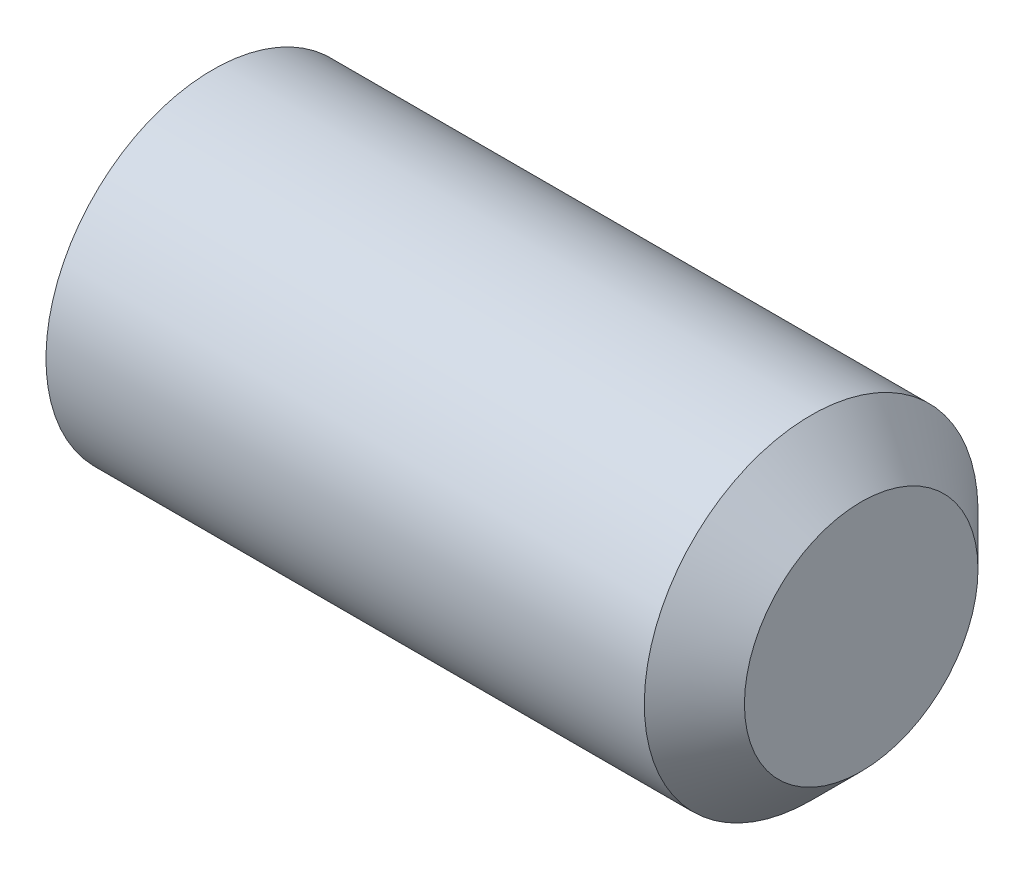
ISO-10303-21;
HEADER;
FILE_DESCRIPTION(('STEP AP214'),'2;1');
FILE_NAME('part.step','',(''),(''),'','','');
FILE_SCHEMA(('AUTOMOTIVE_DESIGN { 1 0 10303 214 1 1 1 1 }'));
ENDSEC;
DATA;
#1=APPLICATION_CONTEXT('core data for automotive mechanical design processes');
#2=APPLICATION_PROTOCOL_DEFINITION('international standard','automotive_design',2000,#1);
#3=PRODUCT_CONTEXT('',#1,'mechanical');
#4=PRODUCT('Part','Part','',(#3));
#5=PRODUCT_RELATED_PRODUCT_CATEGORY('part','',(#4));
#6=PRODUCT_DEFINITION_FORMATION('','',#4);
#7=PRODUCT_DEFINITION_CONTEXT('part definition',#1,'design');
#8=PRODUCT_DEFINITION('design','',#6,#7);
#9=PRODUCT_DEFINITION_SHAPE('','',#8);
#10=(LENGTH_UNIT() NAMED_UNIT(*) SI_UNIT(.MILLI.,.METRE.));
#11=(NAMED_UNIT(*) PLANE_ANGLE_UNIT() SI_UNIT($,.RADIAN.));
#12=(NAMED_UNIT(*) SI_UNIT($,.STERADIAN.) SOLID_ANGLE_UNIT());
#13=UNCERTAINTY_MEASURE_WITH_UNIT(LENGTH_MEASURE(1.E-05),#10,'distance_accuracy_value','');
#14=(GEOMETRIC_REPRESENTATION_CONTEXT(3) GLOBAL_UNCERTAINTY_ASSIGNED_CONTEXT((#13)) GLOBAL_UNIT_ASSIGNED_CONTEXT((#10,
#11,#12)) REPRESENTATION_CONTEXT('',''));
#15=CARTESIAN_POINT('',(0.,0.,0.));
#16=DIRECTION('',(0.,0.,1.));
#17=DIRECTION('',(1.,0.,0.));
#18=AXIS2_PLACEMENT_3D('',#15,#16,#17);
#19=CARTESIAN_POINT('',(0.83333333333333,0.,0.));
#20=DIRECTION('',(-1.,0.,0.));
#21=DIRECTION('',(0.,-1.,0.));
#22=AXIS2_PLACEMENT_3D('',#19,#20,#21);
#23=CONICAL_SURFACE('',#22,0.,1.04719755119661);
#24=CARTESIAN_POINT('',(0.,0.,0.));
#25=DIRECTION('',(-1.,0.,0.));
#26=DIRECTION('',(0.,-1.,0.));
#27=AXIS2_PLACEMENT_3D('',#24,#25,#26);
#28=CIRCLE('',#27,1.4433756729741);
#29=CARTESIAN_POINT('',(0.,0.,1.4433756729741));
#30=VERTEX_POINT('',#29);
#31=CARTESIAN_POINT('',(0.,1.25000000000006,0.721687836486994));
#32=VERTEX_POINT('',#31);
#33=EDGE_CURVE('E133',#30,#32,#28,.T.);
#34=ORIENTED_EDGE('',*,*,#33,.T.);
#35=CARTESIAN_POINT('',(-6.667466600569E-05,1.2502,0.721572366433192));
#36=CARTESIAN_POINT('',(0.01825408523633,1.19526669476824,0.753288124996229));
#37=CARTESIAN_POINT('',(0.0349166937993818,1.13985921349976,0.785277649221703));
#38=CARTESIAN_POINT('',(0.0640026960542467,1.02808463239966,0.849810733708406));
#39=CARTESIAN_POINT('',(0.0764157980239654,0.971715545158294,0.882355441401186));
#40=CARTESIAN_POINT('',(0.0957403123640013,0.859676025913021,0.947041487997324));
#41=CARTESIAN_POINT('',(0.10278031055258,0.804022841540777,0.9791728689759));
#42=CARTESIAN_POINT('',(0.111187567369377,0.692454346091617,1.04358696985656));
#43=CARTESIAN_POINT('',(0.112561784795285,0.636539441062409,1.07586945532689));
#44=CARTESIAN_POINT('',(0.109716662632088,0.532042078818284,1.13620103554814));
#45=CARTESIAN_POINT('',(0.106195901179992,0.483444050118692,1.16425912049994));
#46=CARTESIAN_POINT('',(0.0950328873007498,0.386564637826768,1.22019247526561));
#47=CARTESIAN_POINT('',(0.0873868144273279,0.338283589807842,1.2480675513361));
#48=CARTESIAN_POINT('',(0.0682705452994721,0.241204116145961,1.30411641158758));
#49=CARTESIAN_POINT('',(0.0567192430203453,0.192417989648104,1.33228309485383));
#50=CARTESIAN_POINT('',(0.0305016853061096,0.0955737477078995,1.38819614400748));
#51=CARTESIAN_POINT('',(0.0158415978608945,0.0475143896730366,1.41594322730599));
#52=CARTESIAN_POINT('',(-6.66746660268139E-05,-0.000199999999999919,1.44349114302794));
#53=B_SPLINE_CURVE_WITH_KNOTS('',3,(#35,#36,#37,#38,#39,#40,#41,#42,#43,#44,#45,#46,#47,#48,#49,
#50,#51,#52),.UNSPECIFIED.,.F.,.F.,(4,2,2,2,2,2,2,2,4),(0.,0.198150821029558,0.396778196315219,
0.590488617354397,0.783961049317179,0.952480056398648,1.1211553973001,1.29357430343591,
1.46565426976932),.UNSPECIFIED.);
#54=EDGE_CURVE('E11',#32,#30,#53,.T.);
#55=ORIENTED_EDGE('',*,*,#54,.T.);
#56=EDGE_LOOP('',(#34,#55));
#57=FACE_BOUND('',#56,.T.);
#58=ADVANCED_FACE('F31',(#57),#23,.F.);
#59=CARTESIAN_POINT('',(0.,-1.25,0.72168783648703));
#60=VERTEX_POINT('',#59);
#61=EDGE_CURVE('E129',#60,#30,#28,.T.);
#62=ORIENTED_EDGE('',*,*,#61,.T.);
#63=CARTESIAN_POINT('',(-6.66746660267947E-05,0.0002,1.44349114302794));
#64=CARTESIAN_POINT('',(0.0182540852363106,-0.0547333052317654,1.4117753844649));
#65=CARTESIAN_POINT('',(0.0349166937993642,-0.11014078650024,1.37978586023943));
#66=CARTESIAN_POINT('',(0.064002696054233,-0.221915367600341,1.31525277575272));
#67=CARTESIAN_POINT('',(0.0764157980239536,-0.278284454841712,1.28270806805994));
#68=CARTESIAN_POINT('',(0.0957403123639934,-0.390323974086986,1.2180220214638));
#69=CARTESIAN_POINT('',(0.102780310552574,-0.445977158459232,1.18589064048522));
#70=CARTESIAN_POINT('',(0.111187567369375,-0.557545653908395,1.12147653960457));
#71=CARTESIAN_POINT('',(0.112561784795285,-0.613460558937604,1.08919405413424));
#72=CARTESIAN_POINT('',(0.109716662632091,-0.717957921181729,1.02886247391298));
#73=CARTESIAN_POINT('',(0.106195901179996,-0.766555949881319,1.00080438896119));
#74=CARTESIAN_POINT('',(0.0950328873007579,-0.863435362173241,0.944871034195511));
#75=CARTESIAN_POINT('',(0.0873868144273376,-0.911716410192165,0.916995958125027));
#76=CARTESIAN_POINT('',(0.0682705452994852,-1.00879588385404,0.860947097873551));
#77=CARTESIAN_POINT('',(0.0567192430203601,-1.0575820103519,0.832780414607293));
#78=CARTESIAN_POINT('',(0.0305016853061278,-1.1544262522921,0.776867365453649));
#79=CARTESIAN_POINT('',(0.0158415978609144,-1.20248561032696,0.749120282155139));
#80=CARTESIAN_POINT('',(-6.66746660053359E-05,-1.2502,0.721572366433192));
#81=B_SPLINE_CURVE_WITH_KNOTS('',3,(#63,#64,#65,#66,#67,#68,#69,#70,#71,#72,#73,#74,#75,#76,#77,
#78,#79,#80),.UNSPECIFIED.,.F.,.F.,(4,2,2,2,2,2,2,2,4),(0.,0.198150821029563,0.396778196315229,
0.590488617354411,0.783961049317198,0.952480056398662,1.12115539730011,1.29357430343592,
1.46565426976932),.UNSPECIFIED.);
#82=EDGE_CURVE('E44',#30,#60,#81,.T.);
#83=ORIENTED_EDGE('',*,*,#82,.T.);
#84=EDGE_LOOP('',(#62,#83));
#85=FACE_BOUND('',#84,.T.);
#86=ADVANCED_FACE('F199',(#85),#23,.F.);
#87=CARTESIAN_POINT('',(0.,-1.25,-0.72168783648703));
#88=VERTEX_POINT('',#87);
#89=EDGE_CURVE('E128',#88,#60,#28,.T.);
#90=ORIENTED_EDGE('',*,*,#89,.T.);
#91=CARTESIAN_POINT('',(-0.464794110924318,-1.25,-1.8689314017922));
#92=CARTESIAN_POINT('',(-0.438896838466503,-1.25,-1.81495202267028));
#93=CARTESIAN_POINT('',(-0.41326862193117,-1.25,-1.76084125344199));
#94=CARTESIAN_POINT('',(-0.362702760613372,-1.25,-1.65228662652069));
#95=CARTESIAN_POINT('',(-0.337765240110292,-1.25,-1.5978427110077));
#96=CARTESIAN_POINT('',(-0.288593916349812,-1.25,-1.48823931692677));
#97=CARTESIAN_POINT('',(-0.26436529948678,-1.25,-1.43307750108909));
#98=CARTESIAN_POINT('',(-0.216995070503893,-1.25,-1.32229188443623));
#99=CARTESIAN_POINT('',(-0.1938534018645,-1.25,-1.26666810781964));
#100=CARTESIAN_POINT('',(-0.148354613067788,-1.25,-1.15340083047609));
#101=CARTESIAN_POINT('',(-0.126033815465283,-1.25,-1.09574254265117));
#102=CARTESIAN_POINT('',(-0.0832554769119706,-1.25,-0.979741082890186));
#103=CARTESIAN_POINT('',(-0.0627981694396736,-1.25,-0.921397826164648));
#104=CARTESIAN_POINT('',(-0.00508423767619977,-1.25,-0.745435524772247));
#105=CARTESIAN_POINT('',(0.0286497850231131,-1.25,-0.626561938132864));
#106=CARTESIAN_POINT('',(0.0677795931717897,-1.25,-0.445873083681241));
#107=CARTESIAN_POINT('',(0.0789059393811716,-1.25,-0.38530470019277));
#108=CARTESIAN_POINT('',(0.0965721477324262,-1.25,-0.263486592065033));
#109=CARTESIAN_POINT('',(0.103112319816836,-1.25,-0.202236913753249));
#110=CARTESIAN_POINT('',(0.111001218957225,-1.25,-0.0801324468775872));
#111=CARTESIAN_POINT('',(0.112411208741845,-1.25,-0.0192817197887191));
#112=CARTESIAN_POINT('',(0.110083812113812,-1.25,0.102319232701149));
#113=CARTESIAN_POINT('',(0.106346106973973,-1.25,0.163069451645857));
#114=CARTESIAN_POINT('',(0.0911019719638763,-1.25,0.312961598922923));
#115=CARTESIAN_POINT('',(0.07673875157032,-1.25,0.401813055628261));
#116=CARTESIAN_POINT('',(0.0397001504850788,-1.25,0.577788146583204));
#117=CARTESIAN_POINT('',(0.017014751645873,-1.25,0.664909564430757));
#118=CARTESIAN_POINT('',(-0.0217374532821144,-1.25,0.795209224728803));
#119=CARTESIAN_POINT('',(-0.0356229448102493,-1.25,0.839061001813546));
#120=CARTESIAN_POINT('',(-0.0646784153621005,-1.25,0.926308087473968));
#121=CARTESIAN_POINT('',(-0.0798475927664177,-1.25,0.969703662172475));
#122=CARTESIAN_POINT('',(-0.111250133996538,-1.25,1.05609633508796));
#123=CARTESIAN_POINT('',(-0.127483304422963,-1.25,1.09909350410935));
#124=CARTESIAN_POINT('',(-0.160838243910764,-1.25,1.18474903910482));
#125=CARTESIAN_POINT('',(-0.17796016310432,-1.25,1.22740734642401));
#126=CARTESIAN_POINT('',(-0.222761429232114,-1.25,1.33629459550827));
#127=CARTESIAN_POINT('',(-0.2509693835735,-1.25,1.4023058109203));
#128=CARTESIAN_POINT('',(-0.30874508115846,-1.25,1.53373213594214));
#129=CARTESIAN_POINT('',(-0.338312926269893,-1.25,1.59914720045377));
#130=CARTESIAN_POINT('',(-0.428576920024365,-1.25,1.79469680395945));
#131=CARTESIAN_POINT('',(-0.490824273185165,-1.25,1.92411390982371));
#132=CARTESIAN_POINT('',(-0.617929622902711,-1.25,2.18184246876938));
#133=CARTESIAN_POINT('',(-0.682790734765014,-1.25,2.31015236703664));
#134=CARTESIAN_POINT('',(-0.814180745531415,-1.25,2.56589305685457));
#135=CARTESIAN_POINT('',(-0.880709432442644,-1.25,2.6933239575489));
#136=CARTESIAN_POINT('',(-1.0085820016458,-1.25,2.93557826301824));
#137=CARTESIAN_POINT('',(-1.06982257041214,-1.25,3.05045639113078));
#138=CARTESIAN_POINT('',(-1.19300148004087,-1.25,3.27984311898857));
#139=CARTESIAN_POINT('',(-1.25493984672611,-1.25,3.39435170485541));
#140=CARTESIAN_POINT('',(-1.37918115605609,-1.25,3.6227932787217));
#141=CARTESIAN_POINT('',(-1.44148277067592,-1.25,3.73672698995316));
#142=CARTESIAN_POINT('',(-1.56649149193143,-1.25,3.96436406629498));
#143=CARTESIAN_POINT('',(-1.62919857717608,-1.25,4.0780674431479));
#144=CARTESIAN_POINT('',(-1.69205434936227,-1.25,4.19168806612957));
#145=B_SPLINE_CURVE_WITH_KNOTS('',3,(#91,#92,#93,#94,#95,#96,#97,#98,#99,#100,#101,#102,#103,
#104,#105,#106,#107,#108,#109,#110,#111,#112,#113,#114,#115,#116,#117,#118,#119,#120,#121,#122,
#123,#124,#125,#126,#127,#128,#129,#130,#131,#132,#133,#134,#135,#136,#137,#138,#139,#140,#141,
#142,#143,#144),.UNSPECIFIED.,.F.,.F.,(4,2,2,2,2,2,2,2,2,2,2,2,2,2,2,2,2,2,2,2,2,2,2,2,2,2,4),
(0.,0.17961292671252,0.359257964580633,0.539992735616922,0.720718098311231,0.906167781883899,
1.09164066876281,1.46154014621253,1.64614554413151,1.83073846485716,2.01311967401944,
2.1955121760931,2.46497297688038,2.73475922178122,2.87273702323334,3.01062928909402,
3.14849655975692,3.28638719597095,3.50172172546914,3.71707241178646,4.14784491349871,
4.57914698286387,5.01039449766875,5.40093821140483,5.79149642546544,6.18106124184776,
6.57060567131898),.UNSPECIFIED.);
#146=EDGE_CURVE('E175',#60,#88,#145,.F.);
#147=ORIENTED_EDGE('',*,*,#146,.T.);
#148=EDGE_LOOP('',(#90,#147));
#149=FACE_BOUND('',#148,.T.);
#150=ADVANCED_FACE('F205',(#149),#23,.F.);
#151=CARTESIAN_POINT('',(0.,0.,-1.4433756729741));
#152=VERTEX_POINT('',#151);
#153=EDGE_CURVE('E227',#152,#88,#28,.T.);
#154=ORIENTED_EDGE('',*,*,#153,.T.);
#155=CARTESIAN_POINT('',(-6.6674666005365E-05,-1.2502,-0.721572366433192));
#156=CARTESIAN_POINT('',(0.0182540852363302,-1.19526669476824,-0.753288124996229));
#157=CARTESIAN_POINT('',(0.0349166937993819,-1.13985921349976,-0.785277649221703));
#158=CARTESIAN_POINT('',(0.064002696054247,-1.02808463239966,-0.849810733708406));
#159=CARTESIAN_POINT('',(0.0764157980239657,-0.971715545158294,-0.882355441401186));
#160=CARTESIAN_POINT('',(0.0957403123640016,-0.859676025913021,-0.947041487997324));
#161=CARTESIAN_POINT('',(0.10278031055258,-0.804022841540777,-0.9791728689759));
#162=CARTESIAN_POINT('',(0.111187567369377,-0.692454346091617,-1.04358696985656));
#163=CARTESIAN_POINT('',(0.112561784795285,-0.636539441062409,-1.07586945532689));
#164=CARTESIAN_POINT('',(0.109716662632088,-0.532042078818284,-1.13620103554814));
#165=CARTESIAN_POINT('',(0.106195901179992,-0.483444050118693,-1.16425912049994));
#166=CARTESIAN_POINT('',(0.09503288730075,-0.386564637826768,-1.22019247526561));
#167=CARTESIAN_POINT('',(0.087386814427328,-0.338283589807842,-1.2480675513361));
#168=CARTESIAN_POINT('',(0.0682705452994722,-0.241204116145961,-1.30411641158758));
#169=CARTESIAN_POINT('',(0.0567192430203454,-0.192417989648104,-1.33228309485383));
#170=CARTESIAN_POINT('',(0.0305016853061098,-0.0955737477078995,-1.38819614400748));
#171=CARTESIAN_POINT('',(0.0158415978608947,-0.0475143896730366,-1.41594322730599));
#172=CARTESIAN_POINT('',(-6.66746660267868E-05,0.000199999999999902,-1.44349114302794));
#173=B_SPLINE_CURVE_WITH_KNOTS('',3,(#155,#156,#157,#158,#159,#160,#161,#162,#163,#164,#165,
#166,#167,#168,#169,#170,#171,#172),.UNSPECIFIED.,.F.,.F.,(4,2,2,2,2,2,2,2,4),(0.,
0.198150821029558,0.396778196315219,0.590488617354397,0.783961049317178,0.952480056398648,
1.1211553973001,1.29357430343591,1.46565426976932),.UNSPECIFIED.);
#174=EDGE_CURVE('E170',#88,#152,#173,.T.);
#175=ORIENTED_EDGE('',*,*,#174,.T.);
#176=EDGE_LOOP('',(#154,#175));
#177=FACE_BOUND('',#176,.T.);
#178=ADVANCED_FACE('F217',(#177),#23,.F.);
#179=CARTESIAN_POINT('',(0.,1.25,-0.72168783648703));
#180=VERTEX_POINT('',#179);
#181=EDGE_CURVE('E225',#180,#152,#28,.T.);
#182=ORIENTED_EDGE('',*,*,#181,.T.);
#183=CARTESIAN_POINT('',(-6.66746660267947E-05,-0.0002,-1.44349114302794));
#184=CARTESIAN_POINT('',(0.0182540852363107,0.0547333052317654,-1.4117753844649));
#185=CARTESIAN_POINT('',(0.0349166937993643,0.11014078650024,-1.37978586023943));
#186=CARTESIAN_POINT('',(0.0640026960542331,0.221915367600341,-1.31525277575272));
#187=CARTESIAN_POINT('',(0.0764157980239537,0.278284454841712,-1.28270806805994));
#188=CARTESIAN_POINT('',(0.0957403123639935,0.390323974086987,-1.2180220214638));
#189=CARTESIAN_POINT('',(0.102780310552574,0.445977158459232,-1.18589064048522));
#190=CARTESIAN_POINT('',(0.111187567369375,0.557545653908395,-1.12147653960457));
#191=CARTESIAN_POINT('',(0.112561784795285,0.613460558937604,-1.08919405413424));
#192=CARTESIAN_POINT('',(0.109716662632091,0.717957921181729,-1.02886247391298));
#193=CARTESIAN_POINT('',(0.106195901179996,0.766555949881319,-1.00080438896119));
#194=CARTESIAN_POINT('',(0.0950328873007576,0.863435362173241,-0.944871034195511));
#195=CARTESIAN_POINT('',(0.0873868144273374,0.911716410192166,-0.916995958125026));
#196=CARTESIAN_POINT('',(0.0682705452994849,1.00879588385404,-0.86094709787355));
#197=CARTESIAN_POINT('',(0.0567192430203598,1.0575820103519,-0.832780414607293));
#198=CARTESIAN_POINT('',(0.0305016853061274,1.1544262522921,-0.776867365453649));
#199=CARTESIAN_POINT('',(0.015841597860914,1.20248561032696,-0.74912028215514));
#200=CARTESIAN_POINT('',(-6.66746660057536E-05,1.2502,-0.721572366433192));
#201=B_SPLINE_CURVE_WITH_KNOTS('',3,(#183,#184,#185,#186,#187,#188,#189,#190,#191,#192,#193,
#194,#195,#196,#197,#198,#199,#200),.UNSPECIFIED.,.F.,.F.,(4,2,2,2,2,2,2,2,4),(0.,
0.198150821029563,0.396778196315229,0.590488617354412,0.783961049317198,0.952480056398663,
1.12115539730011,1.29357430343592,1.46565426976932),.UNSPECIFIED.);
#202=EDGE_CURVE('E111',#152,#180,#201,.T.);
#203=ORIENTED_EDGE('',*,*,#202,.T.);
#204=EDGE_LOOP('',(#182,#203));
#205=FACE_BOUND('',#204,.T.);
#206=ADVANCED_FACE('F209',(#205),#23,.F.);
#207=EDGE_CURVE('E221',#32,#180,#28,.T.);
#208=ORIENTED_EDGE('',*,*,#207,.T.);
#209=CARTESIAN_POINT('',(-0.464794110924318,1.25,-1.8689314017922));
#210=CARTESIAN_POINT('',(-0.438896838466503,1.25,-1.81495202267028));
#211=CARTESIAN_POINT('',(-0.41326862193117,1.25,-1.76084125344199));
#212=CARTESIAN_POINT('',(-0.362702760613372,1.25,-1.65228662652069));
#213=CARTESIAN_POINT('',(-0.337765240110292,1.25,-1.5978427110077));
#214=CARTESIAN_POINT('',(-0.288593916349812,1.25,-1.48823931692677));
#215=CARTESIAN_POINT('',(-0.26436529948678,1.25,-1.43307750108909));
#216=CARTESIAN_POINT('',(-0.216995070503893,1.25,-1.32229188443623));
#217=CARTESIAN_POINT('',(-0.1938534018645,1.25,-1.26666810781964));
#218=CARTESIAN_POINT('',(-0.148354613067788,1.25,-1.15340083047609));
#219=CARTESIAN_POINT('',(-0.126033815465283,1.25,-1.09574254265116));
#220=CARTESIAN_POINT('',(-0.0832554769119708,1.25,-0.979741082890186));
#221=CARTESIAN_POINT('',(-0.0627981694396738,1.25,-0.921397826164648));
#222=CARTESIAN_POINT('',(-0.0050842376762001,1.25,-0.745435524772246));
#223=CARTESIAN_POINT('',(0.0286497850231126,1.25,-0.626561938132864));
#224=CARTESIAN_POINT('',(0.0677795931717892,1.25,-0.445873083681241));
#225=CARTESIAN_POINT('',(0.0789059393811712,1.25,-0.38530470019277));
#226=CARTESIAN_POINT('',(0.0965721477324258,1.25,-0.263486592065032));
#227=CARTESIAN_POINT('',(0.103112319816835,1.25,-0.202236913753249));
#228=CARTESIAN_POINT('',(0.111001218957225,1.25,-0.0801324468775868));
#229=CARTESIAN_POINT('',(0.112411208741845,1.25,-0.0192817197887186));
#230=CARTESIAN_POINT('',(0.110083812113811,1.25,0.10231923270115));
#231=CARTESIAN_POINT('',(0.106346106973973,1.25,0.163069451645857));
#232=CARTESIAN_POINT('',(0.0911019719638757,1.25,0.312961598922924));
#233=CARTESIAN_POINT('',(0.0767387515703193,1.25,0.401813055628261));
#234=CARTESIAN_POINT('',(0.0397001504850779,1.25,0.577788146583205));
#235=CARTESIAN_POINT('',(0.0170147516458721,1.25,0.664909564430757));
#236=CARTESIAN_POINT('',(-0.0217374532821151,1.25,0.795209224728804));
#237=CARTESIAN_POINT('',(-0.0356229448102498,1.25,0.839061001813547));
#238=CARTESIAN_POINT('',(-0.0646784153621009,1.25,0.926308087473968));
#239=CARTESIAN_POINT('',(-0.0798475927664181,1.25,0.969703662172476));
#240=CARTESIAN_POINT('',(-0.111250133996538,1.25,1.05609633508796));
#241=CARTESIAN_POINT('',(-0.127483304422964,1.25,1.09909350410935));
#242=CARTESIAN_POINT('',(-0.160838243910764,1.25,1.18474903910482));
#243=CARTESIAN_POINT('',(-0.177960163104321,1.25,1.22740734642401));
#244=CARTESIAN_POINT('',(-0.222761429232114,1.25,1.33629459550827));
#245=CARTESIAN_POINT('',(-0.250969383573501,1.25,1.40230581092031));
#246=CARTESIAN_POINT('',(-0.30874508115846,1.25,1.53373213594214));
#247=CARTESIAN_POINT('',(-0.338312926269894,1.25,1.59914720045377));
#248=CARTESIAN_POINT('',(-0.428576920024366,1.25,1.79469680395945));
#249=CARTESIAN_POINT('',(-0.490824273185165,1.25,1.92411390982371));
#250=CARTESIAN_POINT('',(-0.617929622902712,1.25,2.18184246876939));
#251=CARTESIAN_POINT('',(-0.682790734765015,1.25,2.31015236703664));
#252=CARTESIAN_POINT('',(-0.814180745531416,1.25,2.56589305685457));
#253=CARTESIAN_POINT('',(-0.880709432442645,1.25,2.6933239575489));
#254=CARTESIAN_POINT('',(-1.0085820016458,1.25,2.93557826301824));
#255=CARTESIAN_POINT('',(-1.06982257041214,1.25,3.05045639113078));
#256=CARTESIAN_POINT('',(-1.19300148004087,1.25,3.27984311898857));
#257=CARTESIAN_POINT('',(-1.25493984672611,1.25,3.39435170485541));
#258=CARTESIAN_POINT('',(-1.3791811560561,1.25,3.62279327872171));
#259=CARTESIAN_POINT('',(-1.44148277067592,1.25,3.73672698995316));
#260=CARTESIAN_POINT('',(-1.56649149193143,1.25,3.96436406629498));
#261=CARTESIAN_POINT('',(-1.62919857717608,1.25,4.07806744314791));
#262=CARTESIAN_POINT('',(-1.69205434936227,1.25,4.19168806612957));
#263=B_SPLINE_CURVE_WITH_KNOTS('',3,(#209,#210,#211,#212,#213,#214,#215,#216,#217,#218,#219,
#220,#221,#222,#223,#224,#225,#226,#227,#228,#229,#230,#231,#232,#233,#234,#235,#236,#237,#238,
#239,#240,#241,#242,#243,#244,#245,#246,#247,#248,#249,#250,#251,#252,#253,#254,#255,#256,#257,
#258,#259,#260,#261,#262),.UNSPECIFIED.,.F.,.F.,(4,2,2,2,2,2,2,2,2,2,2,2,2,2,2,2,2,2,2,2,2,2,2,
2,2,2,4),(0.,0.17961292671252,0.359257964580634,0.539992735616922,0.720718098311232,
0.9061677818839,1.09164066876281,1.46154014621253,1.64614554413151,1.83073846485716,
2.01311967401944,2.1955121760931,2.46497297688039,2.73475922178122,2.87273702323334,
3.01062928909402,3.14849655975692,3.28638719597095,3.50172172546914,3.71707241178646,
4.14784491349871,4.57914698286387,5.01039449766875,5.40093821140483,5.79149642546544,
6.18106124184777,6.57060567131898),.UNSPECIFIED.);
#264=EDGE_CURVE('E77',#180,#32,#263,.T.);
#265=ORIENTED_EDGE('',*,*,#264,.T.);
#266=EDGE_LOOP('',(#208,#265));
#267=FACE_BOUND('',#266,.T.);
#268=ADVANCED_FACE('F201',(#267),#23,.F.);
#269=CARTESIAN_POINT('',(10.,0.,0.));
#270=DIRECTION('',(1.,0.,0.));
#271=DIRECTION('',(0.,1.,0.));
#272=AXIS2_PLACEMENT_3D('',#269,#270,#271);
#273=PLANE('',#272);
#274=CARTESIAN_POINT('',(10.,0.,0.));
#275=DIRECTION('',(-1.,0.,0.));
#276=DIRECTION('',(0.,-1.,0.));
#277=AXIS2_PLACEMENT_3D('',#274,#275,#276);
#278=CIRCLE('',#277,1.75);
#279=CARTESIAN_POINT('',(10.,-1.75,0.));
#280=VERTEX_POINT('',#279);
#281=EDGE_CURVE('E142',#280,#280,#278,.T.);
#282=ORIENTED_EDGE('',*,*,#281,.F.);
#283=EDGE_LOOP('',(#282));
#284=FACE_BOUND('',#283,.T.);
#285=ADVANCED_FACE('F33',(#284),#273,.T.);
#286=CARTESIAN_POINT('',(9.25,0.,0.));
#287=DIRECTION('',(-1.,0.,0.));
#288=DIRECTION('',(0.,-1.,0.));
#289=AXIS2_PLACEMENT_3D('',#286,#287,#288);
#290=CONICAL_SURFACE('',#289,2.5,0.785398163397448);
#291=ORIENTED_EDGE('',*,*,#281,.T.);
#292=EDGE_LOOP('',(#291));
#293=FACE_BOUND('',#292,.T.);
#294=CARTESIAN_POINT('',(9.25,0.,0.));
#295=DIRECTION('',(-1.,0.,0.));
#296=DIRECTION('',(0.,-1.,0.));
#297=AXIS2_PLACEMENT_3D('',#294,#295,#296);
#298=CIRCLE('',#297,2.5);
#299=CARTESIAN_POINT('',(9.25,-2.5,0.));
#300=VERTEX_POINT('',#299);
#301=EDGE_CURVE('E139',#300,#300,#298,.T.);
#302=ORIENTED_EDGE('',*,*,#301,.F.);
#303=EDGE_LOOP('',(#302));
#304=FACE_BOUND('',#303,.T.);
#305=ADVANCED_FACE('F215',(#293,#304),#290,.T.);
#306=CARTESIAN_POINT('',(0.83333333333333,0.,0.));
#307=DIRECTION('',(-1.,0.,0.));
#308=DIRECTION('',(0.,-1.,0.));
#309=AXIS2_PLACEMENT_3D('',#306,#307,#308);
#310=CYLINDRICAL_SURFACE('',#309,2.5);
#311=ORIENTED_EDGE('',*,*,#301,.T.);
#312=EDGE_LOOP('',(#311));
#313=FACE_BOUND('',#312,.T.);
#314=CARTESIAN_POINT('',(0.28319030703751,0.,0.));
#315=DIRECTION('',(-1.,0.,0.));
#316=DIRECTION('',(0.,-1.,0.));
#317=AXIS2_PLACEMENT_3D('',#314,#315,#316);
#318=CIRCLE('',#317,2.5);
#319=CARTESIAN_POINT('',(0.28319030703751,-2.5,0.));
#320=VERTEX_POINT('',#319);
#321=EDGE_CURVE('E136',#320,#320,#318,.T.);
#322=ORIENTED_EDGE('',*,*,#321,.F.);
#323=EDGE_LOOP('',(#322));
#324=FACE_BOUND('',#323,.T.);
#325=ADVANCED_FACE('F324',(#313,#324),#310,.T.);
#326=CARTESIAN_POINT('',(0.,0.,0.));
#327=DIRECTION('',(1.,0.,0.));
#328=DIRECTION('',(0.,1.,0.));
#329=AXIS2_PLACEMENT_3D('',#326,#327,#328);
#330=CONICAL_SURFACE('',#329,2.0095,1.0471975511966);
#331=ORIENTED_EDGE('',*,*,#321,.T.);
#332=EDGE_LOOP('',(#331));
#333=FACE_BOUND('',#332,.T.);
#334=CARTESIAN_POINT('',(0.,0.,0.));
#335=DIRECTION('',(-1.,0.,0.));
#336=DIRECTION('',(0.,-1.,0.));
#337=AXIS2_PLACEMENT_3D('',#334,#335,#336);
#338=CIRCLE('',#337,2.0095);
#339=CARTESIAN_POINT('',(0.,-2.0095,0.));
#340=VERTEX_POINT('',#339);
#341=EDGE_CURVE('E132',#340,#340,#338,.T.);
#342=ORIENTED_EDGE('',*,*,#341,.F.);
#343=EDGE_LOOP('',(#342));
#344=FACE_BOUND('',#343,.T.);
#345=ADVANCED_FACE('F196',(#333,#344),#330,.T.);
#346=CARTESIAN_POINT('',(0.,-2.0095,0.));
#347=DIRECTION('',(-1.,0.,0.));
#348=DIRECTION('',(0.,-1.,0.));
#349=AXIS2_PLACEMENT_3D('',#346,#347,#348);
#350=PLANE('',#349);
#351=ORIENTED_EDGE('',*,*,#341,.T.);
#352=EDGE_LOOP('',(#351));
#353=FACE_BOUND('',#352,.T.);
#354=ORIENTED_EDGE('',*,*,#61,.F.);
#355=ORIENTED_EDGE('',*,*,#89,.F.);
#356=ORIENTED_EDGE('',*,*,#153,.F.);
#357=ORIENTED_EDGE('',*,*,#181,.F.);
#358=ORIENTED_EDGE('',*,*,#207,.F.);
#359=ORIENTED_EDGE('',*,*,#33,.F.);
#360=EDGE_LOOP('',(#354,#355,#356,#357,#358,#359));
#361=FACE_BOUND('',#360,.T.);
#362=ADVANCED_FACE('F191',(#353,#361),#350,.T.);
#363=CARTESIAN_POINT('',(3.,1.25,0.72168783648703));
#364=DIRECTION('',(0.,-0.50000000000002,-0.866025403784427));
#365=DIRECTION('',(0.,0.866025403784427,-0.50000000000002));
#366=AXIS2_PLACEMENT_3D('',#363,#364,#365);
#367=PLANE('',#366);
#368=DIRECTION('',(-1.,0.,0.));
#369=VECTOR('',#368,1.);
#370=CARTESIAN_POINT('',(3.,1.25,0.72168783648703));
#371=LINE('',#370,#369);
#372=CARTESIAN_POINT('',(3.,1.25,0.72168783648703));
#373=VERTEX_POINT('',#372);
#374=EDGE_CURVE('E51',#373,#32,#371,.T.);
#375=ORIENTED_EDGE('',*,*,#374,.F.);
#376=DIRECTION('',(0.,-0.866025403784427,0.50000000000002));
#377=VECTOR('',#376,1.);
#378=CARTESIAN_POINT('',(3.,1.25,0.72168783648703));
#379=LINE('',#378,#377);
#380=CARTESIAN_POINT('',(3.,0.,1.4433756729741));
#381=VERTEX_POINT('',#380);
#382=EDGE_CURVE('E237',#373,#381,#379,.T.);
#383=ORIENTED_EDGE('',*,*,#382,.T.);
#384=DIRECTION('',(-1.,0.,0.));
#385=VECTOR('',#384,1.);
#386=CARTESIAN_POINT('',(3.,0.,1.4433756729741));
#387=LINE('',#386,#385);
#388=EDGE_CURVE('E125',#381,#30,#387,.T.);
#389=ORIENTED_EDGE('',*,*,#388,.T.);
#390=ORIENTED_EDGE('',*,*,#54,.F.);
#391=EDGE_LOOP('',(#375,#383,#389,#390));
#392=FACE_BOUND('',#391,.T.);
#393=ADVANCED_FACE('F187',(#392),#367,.T.);
#394=CARTESIAN_POINT('',(3.,0.,1.4433756729741));
#395=DIRECTION('',(0.,0.50000000000002,-0.866025403784427));
#396=DIRECTION('',(0.,0.866025403784427,0.50000000000002));
#397=AXIS2_PLACEMENT_3D('',#394,#395,#396);
#398=PLANE('',#397);
#399=ORIENTED_EDGE('',*,*,#388,.F.);
#400=DIRECTION('',(0.,-0.866025403784427,-0.50000000000002));
#401=VECTOR('',#400,1.);
#402=CARTESIAN_POINT('',(3.,0.,1.4433756729741));
#403=LINE('',#402,#401);
#404=CARTESIAN_POINT('',(3.,-1.25,0.72168783648703));
#405=VERTEX_POINT('',#404);
#406=EDGE_CURVE('E86',#381,#405,#403,.T.);
#407=ORIENTED_EDGE('',*,*,#406,.T.);
#408=DIRECTION('',(-1.,0.,0.));
#409=VECTOR('',#408,1.);
#410=CARTESIAN_POINT('',(3.,-1.25,0.72168783648703));
#411=LINE('',#410,#409);
#412=EDGE_CURVE('E122',#405,#60,#411,.T.);
#413=ORIENTED_EDGE('',*,*,#412,.T.);
#414=ORIENTED_EDGE('',*,*,#82,.F.);
#415=EDGE_LOOP('',(#399,#407,#413,#414));
#416=FACE_BOUND('',#415,.T.);
#417=ADVANCED_FACE('F184',(#416),#398,.T.);
#418=CARTESIAN_POINT('',(3.,-1.25,0.72168783648703));
#419=DIRECTION('',(0.,1.,0.));
#420=DIRECTION('',(0.,0.,1.));
#421=AXIS2_PLACEMENT_3D('',#418,#419,#420);
#422=PLANE('',#421);
#423=ORIENTED_EDGE('',*,*,#412,.F.);
#424=DIRECTION('',(0.,0.,-1.));
#425=VECTOR('',#424,1.);
#426=CARTESIAN_POINT('',(3.,-1.25,0.72168783648703));
#427=LINE('',#426,#425);
#428=CARTESIAN_POINT('',(3.,-1.25,-0.72168783648703));
#429=VERTEX_POINT('',#428);
#430=EDGE_CURVE('E106',#405,#429,#427,.T.);
#431=ORIENTED_EDGE('',*,*,#430,.T.);
#432=DIRECTION('',(-1.,0.,0.));
#433=VECTOR('',#432,1.);
#434=CARTESIAN_POINT('',(3.,-1.25,-0.72168783648703));
#435=LINE('',#434,#433);
#436=EDGE_CURVE('E103',#429,#88,#435,.T.);
#437=ORIENTED_EDGE('',*,*,#436,.T.);
#438=ORIENTED_EDGE('',*,*,#146,.F.);
#439=EDGE_LOOP('',(#423,#431,#437,#438));
#440=FACE_BOUND('',#439,.T.);
#441=ADVANCED_FACE('F167',(#440),#422,.T.);
#442=CARTESIAN_POINT('',(3.,-1.25,-0.72168783648703));
#443=DIRECTION('',(0.,0.50000000000002,0.866025403784427));
#444=DIRECTION('',(0.,-0.866025403784427,0.50000000000002));
#445=AXIS2_PLACEMENT_3D('',#442,#443,#444);
#446=PLANE('',#445);
#447=ORIENTED_EDGE('',*,*,#436,.F.);
#448=DIRECTION('',(0.,0.866025403784427,-0.50000000000002));
#449=VECTOR('',#448,1.);
#450=CARTESIAN_POINT('',(3.,-1.25,-0.72168783648703));
#451=LINE('',#450,#449);
#452=CARTESIAN_POINT('',(3.,0.,-1.4433756729741));
#453=VERTEX_POINT('',#452);
#454=EDGE_CURVE('E97',#429,#453,#451,.T.);
#455=ORIENTED_EDGE('',*,*,#454,.T.);
#456=DIRECTION('',(-1.,0.,0.));
#457=VECTOR('',#456,1.);
#458=CARTESIAN_POINT('',(3.,0.,-1.4433756729741));
#459=LINE('',#458,#457);
#460=EDGE_CURVE('E100',#453,#152,#459,.T.);
#461=ORIENTED_EDGE('',*,*,#460,.T.);
#462=ORIENTED_EDGE('',*,*,#174,.F.);
#463=EDGE_LOOP('',(#447,#455,#461,#462));
#464=FACE_BOUND('',#463,.T.);
#465=ADVANCED_FACE('F99',(#464),#446,.T.);
#466=CARTESIAN_POINT('',(3.,0.,-1.4433756729741));
#467=DIRECTION('',(0.,-0.50000000000002,0.866025403784427));
#468=DIRECTION('',(0.,-0.866025403784427,-0.50000000000002));
#469=AXIS2_PLACEMENT_3D('',#466,#467,#468);
#470=PLANE('',#469);
#471=ORIENTED_EDGE('',*,*,#460,.F.);
#472=DIRECTION('',(0.,0.866025403784427,0.50000000000002));
#473=VECTOR('',#472,1.);
#474=CARTESIAN_POINT('',(3.,0.,-1.4433756729741));
#475=LINE('',#474,#473);
#476=CARTESIAN_POINT('',(3.,1.25,-0.72168783648703));
#477=VERTEX_POINT('',#476);
#478=EDGE_CURVE('E105',#453,#477,#475,.T.);
#479=ORIENTED_EDGE('',*,*,#478,.T.);
#480=DIRECTION('',(-1.,0.,0.));
#481=VECTOR('',#480,1.);
#482=CARTESIAN_POINT('',(3.,1.25,-0.72168783648703));
#483=LINE('',#482,#481);
#484=EDGE_CURVE('E112',#477,#180,#483,.T.);
#485=ORIENTED_EDGE('',*,*,#484,.T.);
#486=ORIENTED_EDGE('',*,*,#202,.F.);
#487=EDGE_LOOP('',(#471,#479,#485,#486));
#488=FACE_BOUND('',#487,.T.);
#489=ADVANCED_FACE('F109',(#488),#470,.T.);
#490=CARTESIAN_POINT('',(3.,1.25,-0.72168783648703));
#491=DIRECTION('',(0.,-1.,0.));
#492=DIRECTION('',(0.,0.,-1.));
#493=AXIS2_PLACEMENT_3D('',#490,#491,#492);
#494=PLANE('',#493);
#495=ORIENTED_EDGE('',*,*,#484,.F.);
#496=DIRECTION('',(0.,0.,1.));
#497=VECTOR('',#496,1.);
#498=CARTESIAN_POINT('',(3.,1.25,-0.72168783648703));
#499=LINE('',#498,#497);
#500=EDGE_CURVE('E57',#477,#373,#499,.T.);
#501=ORIENTED_EDGE('',*,*,#500,.T.);
#502=ORIENTED_EDGE('',*,*,#374,.T.);
#503=ORIENTED_EDGE('',*,*,#264,.F.);
#504=EDGE_LOOP('',(#495,#501,#502,#503));
#505=FACE_BOUND('',#504,.T.);
#506=ADVANCED_FACE('F157',(#505),#494,.T.);
#507=CARTESIAN_POINT('',(3.,0.,1.4433756729741));
#508=DIRECTION('',(1.,0.,0.));
#509=DIRECTION('',(0.,0.,-1.));
#510=AXIS2_PLACEMENT_3D('',#507,#508,#509);
#511=PLANE('',#510);
#512=ORIENTED_EDGE('',*,*,#382,.F.);
#513=ORIENTED_EDGE('',*,*,#500,.F.);
#514=ORIENTED_EDGE('',*,*,#478,.F.);
#515=ORIENTED_EDGE('',*,*,#454,.F.);
#516=ORIENTED_EDGE('',*,*,#430,.F.);
#517=ORIENTED_EDGE('',*,*,#406,.F.);
#518=EDGE_LOOP('',(#512,#513,#514,#515,#516,#517));
#519=FACE_BOUND('',#518,.T.);
#520=ADVANCED_FACE('F114',(#519),#511,.F.);
#521=CLOSED_SHELL('',(#58,#86,#150,#178,#206,#268,#285,#305,#325,#345,#362,#393,#417,#441,#465,
#489,#506,#520));
#522=MANIFOLD_SOLID_BREP('B2',#521);
#523=ADVANCED_BREP_SHAPE_REPRESENTATION('',(#18,#522),#14);
#524=SHAPE_DEFINITION_REPRESENTATION(#9,#523);
ENDSEC;
END-ISO-10303-21;
